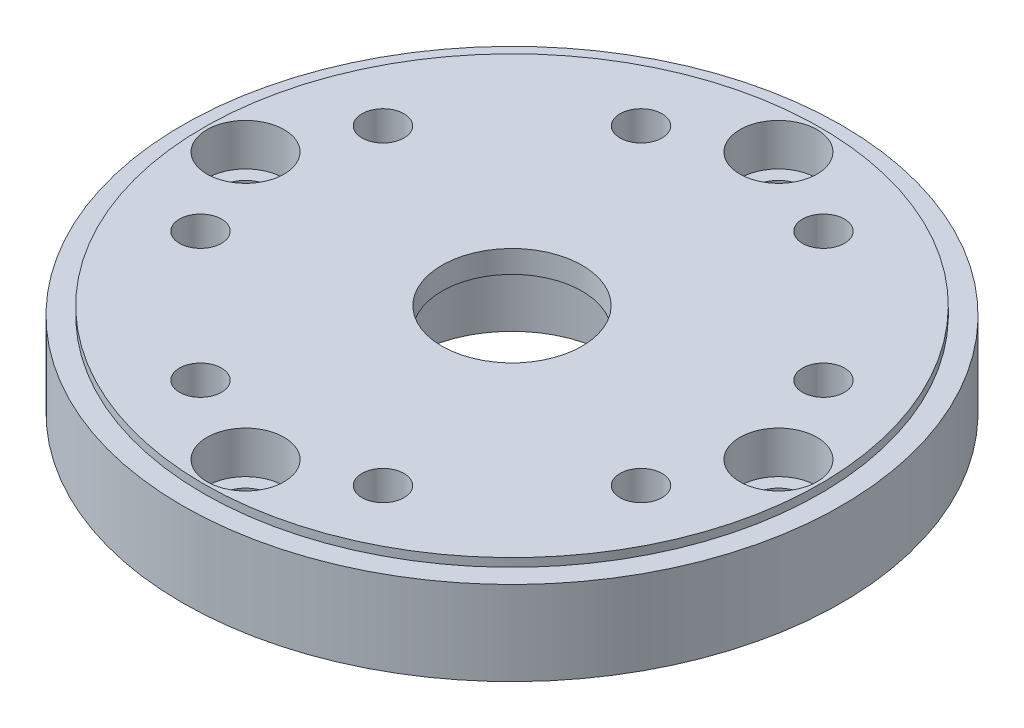
ISO-10303-21;
HEADER;
FILE_DESCRIPTION(('STEP AP214'),'2;1');
FILE_NAME('part.step','',(''),(''),'','','');
FILE_SCHEMA(('AUTOMOTIVE_DESIGN { 1 0 10303 214 1 1 1 1 }'));
ENDSEC;
DATA;
#1=APPLICATION_CONTEXT('core data for automotive mechanical design processes');
#2=APPLICATION_PROTOCOL_DEFINITION('international standard','automotive_design',2000,#1);
#3=PRODUCT_CONTEXT('',#1,'mechanical');
#4=PRODUCT('Part','Part','',(#3));
#5=PRODUCT_RELATED_PRODUCT_CATEGORY('part','',(#4));
#6=PRODUCT_DEFINITION_FORMATION('','',#4);
#7=PRODUCT_DEFINITION_CONTEXT('part definition',#1,'design');
#8=PRODUCT_DEFINITION('design','',#6,#7);
#9=PRODUCT_DEFINITION_SHAPE('','',#8);
#10=(LENGTH_UNIT() NAMED_UNIT(*) SI_UNIT(.MILLI.,.METRE.));
#11=(NAMED_UNIT(*) PLANE_ANGLE_UNIT() SI_UNIT($,.RADIAN.));
#12=(NAMED_UNIT(*) SI_UNIT($,.STERADIAN.) SOLID_ANGLE_UNIT());
#13=UNCERTAINTY_MEASURE_WITH_UNIT(LENGTH_MEASURE(1.E-05),#10,'distance_accuracy_value','');
#14=(GEOMETRIC_REPRESENTATION_CONTEXT(3) GLOBAL_UNCERTAINTY_ASSIGNED_CONTEXT((#13)) GLOBAL_UNIT_ASSIGNED_CONTEXT((#10,
#11,#12)) REPRESENTATION_CONTEXT('',''));
#15=CARTESIAN_POINT('',(0.,0.,0.));
#16=DIRECTION('',(0.,0.,1.));
#17=DIRECTION('',(1.,0.,0.));
#18=AXIS2_PLACEMENT_3D('',#15,#16,#17);
#19=CARTESIAN_POINT('',(-18.9999999999994,6.6,-5.67025844789061E-13));
#20=DIRECTION('',(0.,-1.,0.));
#21=DIRECTION('',(0.,0.,-1.));
#22=AXIS2_PLACEMENT_3D('',#19,#20,#21);
#23=CYLINDRICAL_SURFACE('',#22,1.75);
#24=CARTESIAN_POINT('',(-18.9999999999994,0.,-5.67025844789061E-13));
#25=DIRECTION('',(0.,-1.,0.));
#26=DIRECTION('',(0.,0.,-1.));
#27=AXIS2_PLACEMENT_3D('',#24,#25,#26);
#28=CIRCLE('',#27,1.75);
#29=CARTESIAN_POINT('',(-18.9999999999994,0.,-1.75000000000057));
#30=VERTEX_POINT('',#29);
#31=EDGE_CURVE('E90',#30,#30,#28,.T.);
#32=ORIENTED_EDGE('',*,*,#31,.T.);
#33=EDGE_LOOP('',(#32));
#34=FACE_BOUND('',#33,.T.);
#35=CARTESIAN_POINT('',(-18.9999999999994,3.6,-5.67025844789061E-13));
#36=DIRECTION('',(0.,1.,0.));
#37=DIRECTION('',(0.,0.,1.));
#38=AXIS2_PLACEMENT_3D('',#35,#36,#37);
#39=CIRCLE('',#38,1.75);
#40=CARTESIAN_POINT('',(-18.9999999999994,3.6,1.74999999999943));
#41=VERTEX_POINT('',#40);
#42=EDGE_CURVE('E129',#41,#41,#39,.T.);
#43=ORIENTED_EDGE('',*,*,#42,.T.);
#44=EDGE_LOOP('',(#43));
#45=FACE_BOUND('',#44,.T.);
#46=ADVANCED_FACE('F39',(#34,#45),#23,.F.);
#47=CARTESIAN_POINT('',(1.12939803174136E-12,6.6,-19.));
#48=DIRECTION('',(0.,-1.,0.));
#49=DIRECTION('',(0.,0.,-1.));
#50=AXIS2_PLACEMENT_3D('',#47,#48,#49);
#51=CYLINDRICAL_SURFACE('',#50,1.75);
#52=CARTESIAN_POINT('',(1.12939803174136E-12,0.,-19.));
#53=DIRECTION('',(0.,-1.,0.));
#54=DIRECTION('',(0.,0.,-1.));
#55=AXIS2_PLACEMENT_3D('',#52,#53,#54);
#56=CIRCLE('',#55,1.75);
#57=CARTESIAN_POINT('',(1.12939803174136E-12,0.,-20.75));
#58=VERTEX_POINT('',#57);
#59=EDGE_CURVE('E94',#58,#58,#56,.T.);
#60=ORIENTED_EDGE('',*,*,#59,.T.);
#61=EDGE_LOOP('',(#60));
#62=FACE_BOUND('',#61,.T.);
#63=CARTESIAN_POINT('',(1.12939803174136E-12,3.6,-19.));
#64=DIRECTION('',(0.,1.,0.));
#65=DIRECTION('',(0.,0.,1.));
#66=AXIS2_PLACEMENT_3D('',#63,#64,#65);
#67=CIRCLE('',#66,1.75);
#68=CARTESIAN_POINT('',(1.12939803174136E-12,3.6,-17.25));
#69=VERTEX_POINT('',#68);
#70=EDGE_CURVE('E133',#69,#69,#67,.T.);
#71=ORIENTED_EDGE('',*,*,#70,.T.);
#72=EDGE_LOOP('',(#71));
#73=FACE_BOUND('',#72,.T.);
#74=ADVANCED_FACE('F246',(#62,#73),#51,.F.);
#75=CARTESIAN_POINT('',(19.0000000000006,6.6,5.64699015870681E-13));
#76=DIRECTION('',(0.,-1.,0.));
#77=DIRECTION('',(0.,0.,-1.));
#78=AXIS2_PLACEMENT_3D('',#75,#76,#77);
#79=CYLINDRICAL_SURFACE('',#78,1.75);
#80=CARTESIAN_POINT('',(19.0000000000006,0.,5.64699015870681E-13));
#81=DIRECTION('',(0.,-1.,0.));
#82=DIRECTION('',(0.,0.,-1.));
#83=AXIS2_PLACEMENT_3D('',#80,#81,#82);
#84=CIRCLE('',#83,1.75);
#85=CARTESIAN_POINT('',(19.0000000000006,0.,-1.74999999999944));
#86=VERTEX_POINT('',#85);
#87=EDGE_CURVE('E99',#86,#86,#84,.T.);
#88=ORIENTED_EDGE('',*,*,#87,.T.);
#89=EDGE_LOOP('',(#88));
#90=FACE_BOUND('',#89,.T.);
#91=CARTESIAN_POINT('',(19.0000000000006,3.6,5.64699015870681E-13));
#92=DIRECTION('',(0.,1.,0.));
#93=DIRECTION('',(0.,0.,1.));
#94=AXIS2_PLACEMENT_3D('',#91,#92,#93);
#95=CIRCLE('',#94,1.75);
#96=CARTESIAN_POINT('',(19.0000000000006,3.6,1.75000000000056));
#97=VERTEX_POINT('',#96);
#98=EDGE_CURVE('E118',#97,#97,#95,.T.);
#99=ORIENTED_EDGE('',*,*,#98,.T.);
#100=EDGE_LOOP('',(#99));
#101=FACE_BOUND('',#100,.T.);
#102=ADVANCED_FACE('F252',(#90,#101),#79,.F.);
#103=CARTESIAN_POINT('',(0.,6.6,19.));
#104=DIRECTION('',(0.,-1.,0.));
#105=DIRECTION('',(0.,0.,-1.));
#106=AXIS2_PLACEMENT_3D('',#103,#104,#105);
#107=CYLINDRICAL_SURFACE('',#106,1.75);
#108=CARTESIAN_POINT('',(0.,0.,19.));
#109=DIRECTION('',(0.,-1.,0.));
#110=DIRECTION('',(0.,0.,-1.));
#111=AXIS2_PLACEMENT_3D('',#108,#109,#110);
#112=CIRCLE('',#111,1.75);
#113=CARTESIAN_POINT('',(0.,0.,17.25));
#114=VERTEX_POINT('',#113);
#115=EDGE_CURVE('E89',#114,#114,#112,.T.);
#116=ORIENTED_EDGE('',*,*,#115,.T.);
#117=EDGE_LOOP('',(#116));
#118=FACE_BOUND('',#117,.T.);
#119=CARTESIAN_POINT('',(0.,3.6,19.));
#120=DIRECTION('',(0.,1.,0.));
#121=DIRECTION('',(0.,0.,1.));
#122=AXIS2_PLACEMENT_3D('',#119,#120,#121);
#123=CIRCLE('',#122,1.75);
#124=CARTESIAN_POINT('',(0.,3.6,20.75));
#125=VERTEX_POINT('',#124);
#126=EDGE_CURVE('E105',#125,#125,#123,.T.);
#127=ORIENTED_EDGE('',*,*,#126,.T.);
#128=EDGE_LOOP('',(#127));
#129=FACE_BOUND('',#128,.T.);
#130=ADVANCED_FACE('F259',(#118,#129),#107,.F.);
#131=CARTESIAN_POINT('',(0.,6.,0.));
#132=DIRECTION('',(0.,-1.,0.));
#133=DIRECTION('',(0.,0.,-1.));
#134=AXIS2_PLACEMENT_3D('',#131,#132,#133);
#135=CYLINDRICAL_SURFACE('',#134,7.1);
#136=CARTESIAN_POINT('',(0.,0.,0.));
#137=DIRECTION('',(0.,1.,0.));
#138=DIRECTION('',(0.,0.,1.));
#139=AXIS2_PLACEMENT_3D('',#136,#137,#138);
#140=CIRCLE('',#139,7.1);
#141=CARTESIAN_POINT('',(0.,0.,7.1));
#142=VERTEX_POINT('',#141);
#143=EDGE_CURVE('E61',#142,#142,#140,.T.);
#144=ORIENTED_EDGE('',*,*,#143,.F.);
#145=EDGE_LOOP('',(#144));
#146=FACE_BOUND('',#145,.T.);
#147=CARTESIAN_POINT('',(0.,5.,0.));
#148=DIRECTION('',(0.,1.,0.));
#149=DIRECTION('',(0.,0.,1.));
#150=AXIS2_PLACEMENT_3D('',#147,#148,#149);
#151=CIRCLE('',#150,7.1);
#152=CARTESIAN_POINT('',(0.,5.,7.1));
#153=VERTEX_POINT('',#152);
#154=EDGE_CURVE('E65',#153,#153,#151,.T.);
#155=ORIENTED_EDGE('',*,*,#154,.T.);
#156=EDGE_LOOP('',(#155));
#157=FACE_BOUND('',#156,.T.);
#158=ADVANCED_FACE('F263',(#146,#157),#135,.F.);
#159=CARTESIAN_POINT('',(0.,6.,0.));
#160=DIRECTION('',(0.,1.,0.));
#161=DIRECTION('',(0.,0.,1.));
#162=AXIS2_PLACEMENT_3D('',#159,#160,#161);
#163=PLANE('',#162);
#164=CARTESIAN_POINT('',(0.,6.,0.));
#165=DIRECTION('',(0.,1.,0.));
#166=DIRECTION('',(0.,0.,1.));
#167=AXIS2_PLACEMENT_3D('',#164,#165,#166);
#168=CIRCLE('',#167,22.);
#169=CARTESIAN_POINT('',(0.,6.,22.));
#170=VERTEX_POINT('',#169);
#171=EDGE_CURVE('E10',#170,#170,#168,.T.);
#172=ORIENTED_EDGE('',*,*,#171,.F.);
#173=EDGE_LOOP('',(#172));
#174=FACE_BOUND('',#173,.T.);
#175=CARTESIAN_POINT('',(0.,6.,0.));
#176=DIRECTION('',(0.,1.,0.));
#177=DIRECTION('',(0.,0.,1.));
#178=AXIS2_PLACEMENT_3D('',#175,#176,#177);
#179=CIRCLE('',#178,23.5);
#180=CARTESIAN_POINT('',(0.,6.,23.5));
#181=VERTEX_POINT('',#180);
#182=EDGE_CURVE('E47',#181,#181,#179,.T.);
#183=ORIENTED_EDGE('',*,*,#182,.T.);
#184=EDGE_LOOP('',(#183));
#185=FACE_BOUND('',#184,.T.);
#186=ADVANCED_FACE('F333',(#174,#185),#163,.T.);
#187=CARTESIAN_POINT('',(0.,0.,0.));
#188=DIRECTION('',(0.,1.,0.));
#189=DIRECTION('',(0.,0.,1.));
#190=AXIS2_PLACEMENT_3D('',#187,#188,#189);
#191=PLANE('',#190);
#192=CARTESIAN_POINT('',(-15.7059520526912,0.,-6.50561835020595));
#193=DIRECTION('',(0.,1.,0.));
#194=DIRECTION('',(0.,0.,1.));
#195=AXIS2_PLACEMENT_3D('',#192,#193,#194);
#196=CIRCLE('',#195,1.5);
#197=CARTESIAN_POINT('',(-15.7059520526912,0.,-5.00561835020595));
#198=VERTEX_POINT('',#197);
#199=EDGE_CURVE('E158',#198,#198,#196,.T.);
#200=ORIENTED_EDGE('',*,*,#199,.T.);
#201=EDGE_LOOP('',(#200));
#202=FACE_BOUND('',#201,.T.);
#203=CARTESIAN_POINT('',(-15.7059520526902,0.,6.50561835020699));
#204=DIRECTION('',(0.,1.,0.));
#205=DIRECTION('',(0.,0.,1.));
#206=AXIS2_PLACEMENT_3D('',#203,#204,#205);
#207=CIRCLE('',#206,1.5);
#208=CARTESIAN_POINT('',(-15.7059520526902,0.,8.00561835020699));
#209=VERTEX_POINT('',#208);
#210=EDGE_CURVE('E166',#209,#209,#207,.T.);
#211=ORIENTED_EDGE('',*,*,#210,.T.);
#212=EDGE_LOOP('',(#211));
#213=FACE_BOUND('',#212,.T.);
#214=CARTESIAN_POINT('',(-6.50561835020431,0.,15.7059520526916));
#215=DIRECTION('',(0.,1.,0.));
#216=DIRECTION('',(0.,0.,1.));
#217=AXIS2_PLACEMENT_3D('',#214,#215,#216);
#218=CIRCLE('',#217,1.5);
#219=CARTESIAN_POINT('',(-6.50561835020431,0.,17.2059520526916));
#220=VERTEX_POINT('',#219);
#221=EDGE_CURVE('E174',#220,#220,#218,.T.);
#222=ORIENTED_EDGE('',*,*,#221,.T.);
#223=EDGE_LOOP('',(#222));
#224=FACE_BOUND('',#223,.T.);
#225=CARTESIAN_POINT('',(6.50561835020862,0.,15.7059520526907));
#226=DIRECTION('',(0.,1.,0.));
#227=DIRECTION('',(0.,0.,1.));
#228=AXIS2_PLACEMENT_3D('',#225,#226,#227);
#229=CIRCLE('',#228,1.5);
#230=CARTESIAN_POINT('',(6.50561835020862,0.,17.2059520526907));
#231=VERTEX_POINT('',#230);
#232=EDGE_CURVE('E182',#231,#231,#229,.T.);
#233=ORIENTED_EDGE('',*,*,#232,.T.);
#234=EDGE_LOOP('',(#233));
#235=FACE_BOUND('',#234,.T.);
#236=CARTESIAN_POINT('',(15.7059520526932,0.,6.50561835020476));
#237=DIRECTION('',(0.,1.,0.));
#238=DIRECTION('',(0.,0.,1.));
#239=AXIS2_PLACEMENT_3D('',#236,#237,#238);
#240=CIRCLE('',#239,1.5);
#241=CARTESIAN_POINT('',(15.7059520526932,0.,8.00561835020476));
#242=VERTEX_POINT('',#241);
#243=EDGE_CURVE('E190',#242,#242,#240,.T.);
#244=ORIENTED_EDGE('',*,*,#243,.T.);
#245=EDGE_LOOP('',(#244));
#246=FACE_BOUND('',#245,.T.);
#247=CARTESIAN_POINT('',(15.7059520526923,0.,-6.50561835020817));
#248=DIRECTION('',(0.,1.,0.));
#249=DIRECTION('',(0.,0.,1.));
#250=AXIS2_PLACEMENT_3D('',#247,#248,#249);
#251=CIRCLE('',#250,1.5);
#252=CARTESIAN_POINT('',(15.7059520526923,0.,-5.00561835020817));
#253=VERTEX_POINT('',#252);
#254=EDGE_CURVE('E197',#253,#253,#251,.T.);
#255=ORIENTED_EDGE('',*,*,#254,.T.);
#256=EDGE_LOOP('',(#255));
#257=FACE_BOUND('',#256,.T.);
#258=CARTESIAN_POINT('',(6.5056183502064,0.,-15.7059520526928));
#259=DIRECTION('',(0.,1.,0.));
#260=DIRECTION('',(0.,0.,1.));
#261=AXIS2_PLACEMENT_3D('',#258,#259,#260);
#262=CIRCLE('',#261,1.5);
#263=CARTESIAN_POINT('',(6.5056183502064,0.,-14.2059520526928));
#264=VERTEX_POINT('',#263);
#265=EDGE_CURVE('E204',#264,#264,#262,.T.);
#266=ORIENTED_EDGE('',*,*,#265,.T.);
#267=EDGE_LOOP('',(#266));
#268=FACE_BOUND('',#267,.T.);
#269=CARTESIAN_POINT('',(-6.50561835020654,0.,-15.7059520526919));
#270=DIRECTION('',(0.,1.,0.));
#271=DIRECTION('',(0.,0.,1.));
#272=AXIS2_PLACEMENT_3D('',#269,#270,#271);
#273=CIRCLE('',#272,1.5);
#274=CARTESIAN_POINT('',(-6.50561835020654,0.,-14.2059520526919));
#275=VERTEX_POINT('',#274);
#276=EDGE_CURVE('E114',#275,#275,#273,.T.);
#277=ORIENTED_EDGE('',*,*,#276,.T.);
#278=EDGE_LOOP('',(#277));
#279=FACE_BOUND('',#278,.T.);
#280=ORIENTED_EDGE('',*,*,#115,.F.);
#281=EDGE_LOOP('',(#280));
#282=FACE_BOUND('',#281,.T.);
#283=ORIENTED_EDGE('',*,*,#87,.F.);
#284=EDGE_LOOP('',(#283));
#285=FACE_BOUND('',#284,.T.);
#286=ORIENTED_EDGE('',*,*,#59,.F.);
#287=EDGE_LOOP('',(#286));
#288=FACE_BOUND('',#287,.T.);
#289=ORIENTED_EDGE('',*,*,#31,.F.);
#290=EDGE_LOOP('',(#289));
#291=FACE_BOUND('',#290,.T.);
#292=CARTESIAN_POINT('',(0.,0.,0.));
#293=DIRECTION('',(0.,1.,0.));
#294=DIRECTION('',(0.,0.,1.));
#295=AXIS2_PLACEMENT_3D('',#292,#293,#294);
#296=CIRCLE('',#295,23.5);
#297=CARTESIAN_POINT('',(0.,0.,23.5));
#298=VERTEX_POINT('',#297);
#299=EDGE_CURVE('E54',#298,#298,#296,.T.);
#300=ORIENTED_EDGE('',*,*,#299,.F.);
#301=EDGE_LOOP('',(#300));
#302=FACE_BOUND('',#301,.T.);
#303=ORIENTED_EDGE('',*,*,#143,.T.);
#304=EDGE_LOOP('',(#303));
#305=FACE_BOUND('',#304,.T.);
#306=ADVANCED_FACE('F330',(#202,#213,#224,#235,#246,#257,#268,#279,#282,#285,#288,#291,#302,
#305),#191,.F.);
#307=CARTESIAN_POINT('',(0.,6.,0.));
#308=DIRECTION('',(0.,-1.,0.));
#309=DIRECTION('',(0.,0.,-1.));
#310=AXIS2_PLACEMENT_3D('',#307,#308,#309);
#311=CYLINDRICAL_SURFACE('',#310,23.5);
#312=ORIENTED_EDGE('',*,*,#182,.F.);
#313=EDGE_LOOP('',(#312));
#314=FACE_BOUND('',#313,.T.);
#315=ORIENTED_EDGE('',*,*,#299,.T.);
#316=EDGE_LOOP('',(#315));
#317=FACE_BOUND('',#316,.T.);
#318=ADVANCED_FACE('F41',(#314,#317),#311,.T.);
#319=CARTESIAN_POINT('',(0.,5.,0.));
#320=DIRECTION('',(0.,1.,0.));
#321=DIRECTION('',(0.,0.,1.));
#322=AXIS2_PLACEMENT_3D('',#319,#320,#321);
#323=PLANE('',#322);
#324=CARTESIAN_POINT('',(0.,5.,0.));
#325=DIRECTION('',(0.,1.,0.));
#326=DIRECTION('',(0.,0.,1.));
#327=AXIS2_PLACEMENT_3D('',#324,#325,#326);
#328=CIRCLE('',#327,5.);
#329=CARTESIAN_POINT('',(0.,5.,5.));
#330=VERTEX_POINT('',#329);
#331=EDGE_CURVE('E68',#330,#330,#328,.T.);
#332=ORIENTED_EDGE('',*,*,#331,.T.);
#333=EDGE_LOOP('',(#332));
#334=FACE_BOUND('',#333,.T.);
#335=ORIENTED_EDGE('',*,*,#154,.F.);
#336=EDGE_LOOP('',(#335));
#337=FACE_BOUND('',#336,.T.);
#338=ADVANCED_FACE('F242',(#334,#337),#323,.F.);
#339=CARTESIAN_POINT('',(0.,5.,0.));
#340=DIRECTION('',(0.,1.,0.));
#341=DIRECTION('',(0.,0.,1.));
#342=AXIS2_PLACEMENT_3D('',#339,#340,#341);
#343=CYLINDRICAL_SURFACE('',#342,22.);
#344=ORIENTED_EDGE('',*,*,#171,.T.);
#345=EDGE_LOOP('',(#344));
#346=FACE_BOUND('',#345,.T.);
#347=CARTESIAN_POINT('',(0.,6.6,0.));
#348=DIRECTION('',(0.,1.,0.));
#349=DIRECTION('',(0.,0.,1.));
#350=AXIS2_PLACEMENT_3D('',#347,#348,#349);
#351=CIRCLE('',#350,22.);
#352=CARTESIAN_POINT('',(0.,6.6,22.));
#353=VERTEX_POINT('',#352);
#354=EDGE_CURVE('E77',#353,#353,#351,.T.);
#355=ORIENTED_EDGE('',*,*,#354,.F.);
#356=EDGE_LOOP('',(#355));
#357=FACE_BOUND('',#356,.T.);
#358=ADVANCED_FACE('F236',(#346,#357),#343,.T.);
#359=CARTESIAN_POINT('',(0.,5.,0.));
#360=DIRECTION('',(0.,1.,0.));
#361=DIRECTION('',(0.,0.,1.));
#362=AXIS2_PLACEMENT_3D('',#359,#360,#361);
#363=CYLINDRICAL_SURFACE('',#362,5.);
#364=ORIENTED_EDGE('',*,*,#331,.F.);
#365=EDGE_LOOP('',(#364));
#366=FACE_BOUND('',#365,.T.);
#367=CARTESIAN_POINT('',(0.,6.6,0.));
#368=DIRECTION('',(0.,1.,0.));
#369=DIRECTION('',(0.,0.,1.));
#370=AXIS2_PLACEMENT_3D('',#367,#368,#369);
#371=CIRCLE('',#370,5.);
#372=CARTESIAN_POINT('',(0.,6.6,5.));
#373=VERTEX_POINT('',#372);
#374=EDGE_CURVE('E83',#373,#373,#371,.T.);
#375=ORIENTED_EDGE('',*,*,#374,.T.);
#376=EDGE_LOOP('',(#375));
#377=FACE_BOUND('',#376,.T.);
#378=ADVANCED_FACE('F218',(#366,#377),#363,.F.);
#379=CARTESIAN_POINT('',(0.,6.6,0.));
#380=DIRECTION('',(0.,1.,0.));
#381=DIRECTION('',(0.,0.,1.));
#382=AXIS2_PLACEMENT_3D('',#379,#380,#381);
#383=PLANE('',#382);
#384=CARTESIAN_POINT('',(-15.7059520526912,6.6,-6.50561835020595));
#385=DIRECTION('',(0.,1.,0.));
#386=DIRECTION('',(0.,0.,1.));
#387=AXIS2_PLACEMENT_3D('',#384,#385,#386);
#388=CIRCLE('',#387,1.5);
#389=CARTESIAN_POINT('',(-15.7059520526912,6.6,-5.00561835020595));
#390=VERTEX_POINT('',#389);
#391=EDGE_CURVE('E162',#390,#390,#388,.T.);
#392=ORIENTED_EDGE('',*,*,#391,.F.);
#393=EDGE_LOOP('',(#392));
#394=FACE_BOUND('',#393,.T.);
#395=CARTESIAN_POINT('',(-15.7059520526902,6.6,6.50561835020699));
#396=DIRECTION('',(0.,1.,0.));
#397=DIRECTION('',(0.,0.,1.));
#398=AXIS2_PLACEMENT_3D('',#395,#396,#397);
#399=CIRCLE('',#398,1.5);
#400=CARTESIAN_POINT('',(-15.7059520526902,6.6,8.00561835020699));
#401=VERTEX_POINT('',#400);
#402=EDGE_CURVE('E170',#401,#401,#399,.T.);
#403=ORIENTED_EDGE('',*,*,#402,.F.);
#404=EDGE_LOOP('',(#403));
#405=FACE_BOUND('',#404,.T.);
#406=CARTESIAN_POINT('',(-6.50561835020431,6.6,15.7059520526916));
#407=DIRECTION('',(0.,1.,0.));
#408=DIRECTION('',(0.,0.,1.));
#409=AXIS2_PLACEMENT_3D('',#406,#407,#408);
#410=CIRCLE('',#409,1.5);
#411=CARTESIAN_POINT('',(-6.50561835020431,6.6,17.2059520526916));
#412=VERTEX_POINT('',#411);
#413=EDGE_CURVE('E178',#412,#412,#410,.T.);
#414=ORIENTED_EDGE('',*,*,#413,.F.);
#415=EDGE_LOOP('',(#414));
#416=FACE_BOUND('',#415,.T.);
#417=CARTESIAN_POINT('',(6.50561835020862,6.6,15.7059520526907));
#418=DIRECTION('',(0.,1.,0.));
#419=DIRECTION('',(0.,0.,1.));
#420=AXIS2_PLACEMENT_3D('',#417,#418,#419);
#421=CIRCLE('',#420,1.5);
#422=CARTESIAN_POINT('',(6.50561835020862,6.6,17.2059520526907));
#423=VERTEX_POINT('',#422);
#424=EDGE_CURVE('E186',#423,#423,#421,.T.);
#425=ORIENTED_EDGE('',*,*,#424,.F.);
#426=EDGE_LOOP('',(#425));
#427=FACE_BOUND('',#426,.T.);
#428=CARTESIAN_POINT('',(15.7059520526932,6.6,6.50561835020476));
#429=DIRECTION('',(0.,1.,0.));
#430=DIRECTION('',(0.,0.,1.));
#431=AXIS2_PLACEMENT_3D('',#428,#429,#430);
#432=CIRCLE('',#431,1.5);
#433=CARTESIAN_POINT('',(15.7059520526932,6.6,8.00561835020476));
#434=VERTEX_POINT('',#433);
#435=EDGE_CURVE('E193',#434,#434,#432,.T.);
#436=ORIENTED_EDGE('',*,*,#435,.F.);
#437=EDGE_LOOP('',(#436));
#438=FACE_BOUND('',#437,.T.);
#439=CARTESIAN_POINT('',(15.7059520526923,6.6,-6.50561835020817));
#440=DIRECTION('',(0.,1.,0.));
#441=DIRECTION('',(0.,0.,1.));
#442=AXIS2_PLACEMENT_3D('',#439,#440,#441);
#443=CIRCLE('',#442,1.5);
#444=CARTESIAN_POINT('',(15.7059520526923,6.6,-5.00561835020817));
#445=VERTEX_POINT('',#444);
#446=EDGE_CURVE('E201',#445,#445,#443,.T.);
#447=ORIENTED_EDGE('',*,*,#446,.F.);
#448=EDGE_LOOP('',(#447));
#449=FACE_BOUND('',#448,.T.);
#450=CARTESIAN_POINT('',(6.5056183502064,6.6,-15.7059520526928));
#451=DIRECTION('',(0.,1.,0.));
#452=DIRECTION('',(0.,0.,1.));
#453=AXIS2_PLACEMENT_3D('',#450,#451,#452);
#454=CIRCLE('',#453,1.5);
#455=CARTESIAN_POINT('',(6.5056183502064,6.6,-14.2059520526928));
#456=VERTEX_POINT('',#455);
#457=EDGE_CURVE('E155',#456,#456,#454,.T.);
#458=ORIENTED_EDGE('',*,*,#457,.F.);
#459=EDGE_LOOP('',(#458));
#460=FACE_BOUND('',#459,.T.);
#461=CARTESIAN_POINT('',(-6.50561835020654,6.6,-15.7059520526919));
#462=DIRECTION('',(0.,1.,0.));
#463=DIRECTION('',(0.,0.,1.));
#464=AXIS2_PLACEMENT_3D('',#461,#462,#463);
#465=CIRCLE('',#464,1.5);
#466=CARTESIAN_POINT('',(-6.50561835020654,6.6,-14.2059520526919));
#467=VERTEX_POINT('',#466);
#468=EDGE_CURVE('E151',#467,#467,#465,.T.);
#469=ORIENTED_EDGE('',*,*,#468,.F.);
#470=EDGE_LOOP('',(#469));
#471=FACE_BOUND('',#470,.T.);
#472=CARTESIAN_POINT('',(1.12939803174136E-12,6.6,-19.));
#473=DIRECTION('',(0.,1.,0.));
#474=DIRECTION('',(0.,0.,1.));
#475=AXIS2_PLACEMENT_3D('',#472,#473,#474);
#476=CIRCLE('',#475,2.75);
#477=CARTESIAN_POINT('',(1.12939803174136E-12,6.6,-16.25));
#478=VERTEX_POINT('',#477);
#479=EDGE_CURVE('E141',#478,#478,#476,.T.);
#480=ORIENTED_EDGE('',*,*,#479,.F.);
#481=EDGE_LOOP('',(#480));
#482=FACE_BOUND('',#481,.T.);
#483=CARTESIAN_POINT('',(-18.9999999999994,6.6,-5.67025844789061E-13));
#484=DIRECTION('',(0.,1.,0.));
#485=DIRECTION('',(0.,0.,1.));
#486=AXIS2_PLACEMENT_3D('',#483,#484,#485);
#487=CIRCLE('',#486,2.75);
#488=CARTESIAN_POINT('',(-18.9999999999994,6.6,2.74999999999943));
#489=VERTEX_POINT('',#488);
#490=EDGE_CURVE('E134',#489,#489,#487,.T.);
#491=ORIENTED_EDGE('',*,*,#490,.F.);
#492=EDGE_LOOP('',(#491));
#493=FACE_BOUND('',#492,.T.);
#494=CARTESIAN_POINT('',(19.0000000000006,6.6,5.64699015870681E-13));
#495=DIRECTION('',(0.,1.,0.));
#496=DIRECTION('',(0.,0.,1.));
#497=AXIS2_PLACEMENT_3D('',#494,#495,#496);
#498=CIRCLE('',#497,2.75);
#499=CARTESIAN_POINT('',(19.0000000000006,6.6,2.75000000000056));
#500=VERTEX_POINT('',#499);
#501=EDGE_CURVE('E122',#500,#500,#498,.T.);
#502=ORIENTED_EDGE('',*,*,#501,.F.);
#503=EDGE_LOOP('',(#502));
#504=FACE_BOUND('',#503,.T.);
#505=CARTESIAN_POINT('',(0.,6.6,19.));
#506=DIRECTION('',(0.,1.,0.));
#507=DIRECTION('',(0.,0.,1.));
#508=AXIS2_PLACEMENT_3D('',#505,#506,#507);
#509=CIRCLE('',#508,2.75);
#510=CARTESIAN_POINT('',(0.,6.6,21.75));
#511=VERTEX_POINT('',#510);
#512=EDGE_CURVE('E109',#511,#511,#509,.T.);
#513=ORIENTED_EDGE('',*,*,#512,.F.);
#514=EDGE_LOOP('',(#513));
#515=FACE_BOUND('',#514,.T.);
#516=ORIENTED_EDGE('',*,*,#354,.T.);
#517=EDGE_LOOP('',(#516));
#518=FACE_BOUND('',#517,.T.);
#519=ORIENTED_EDGE('',*,*,#374,.F.);
#520=EDGE_LOOP('',(#519));
#521=FACE_BOUND('',#520,.T.);
#522=ADVANCED_FACE('F214',(#394,#405,#416,#427,#438,#449,#460,#471,#482,#493,#504,#515,#518,
#521),#383,.T.);
#523=CARTESIAN_POINT('',(0.,3.6,19.));
#524=DIRECTION('',(0.,1.,0.));
#525=DIRECTION('',(0.,0.,1.));
#526=AXIS2_PLACEMENT_3D('',#523,#524,#525);
#527=CYLINDRICAL_SURFACE('',#526,2.75);
#528=CARTESIAN_POINT('',(0.,3.6,19.));
#529=DIRECTION('',(0.,1.,0.));
#530=DIRECTION('',(0.,0.,1.));
#531=AXIS2_PLACEMENT_3D('',#528,#529,#530);
#532=CIRCLE('',#531,2.75);
#533=CARTESIAN_POINT('',(0.,3.6,21.75));
#534=VERTEX_POINT('',#533);
#535=EDGE_CURVE('E110',#534,#534,#532,.T.);
#536=ORIENTED_EDGE('',*,*,#535,.F.);
#537=EDGE_LOOP('',(#536));
#538=FACE_BOUND('',#537,.T.);
#539=ORIENTED_EDGE('',*,*,#512,.T.);
#540=EDGE_LOOP('',(#539));
#541=FACE_BOUND('',#540,.T.);
#542=ADVANCED_FACE('F217',(#538,#541),#527,.F.);
#543=CARTESIAN_POINT('',(0.,3.6,19.));
#544=DIRECTION('',(0.,1.,0.));
#545=DIRECTION('',(0.,0.,1.));
#546=AXIS2_PLACEMENT_3D('',#543,#544,#545);
#547=PLANE('',#546);
#548=ORIENTED_EDGE('',*,*,#126,.F.);
#549=EDGE_LOOP('',(#548));
#550=FACE_BOUND('',#549,.T.);
#551=ORIENTED_EDGE('',*,*,#535,.T.);
#552=EDGE_LOOP('',(#551));
#553=FACE_BOUND('',#552,.T.);
#554=ADVANCED_FACE('F265',(#550,#553),#547,.T.);
#555=CARTESIAN_POINT('',(19.0000000000006,3.6,5.64699015870681E-13));
#556=DIRECTION('',(0.,1.,0.));
#557=DIRECTION('',(0.,0.,1.));
#558=AXIS2_PLACEMENT_3D('',#555,#556,#557);
#559=CYLINDRICAL_SURFACE('',#558,2.75);
#560=CARTESIAN_POINT('',(19.0000000000006,3.6,5.64699015870681E-13));
#561=DIRECTION('',(0.,1.,0.));
#562=DIRECTION('',(0.,0.,1.));
#563=AXIS2_PLACEMENT_3D('',#560,#561,#562);
#564=CIRCLE('',#563,2.75);
#565=CARTESIAN_POINT('',(19.0000000000006,3.6,2.75000000000056));
#566=VERTEX_POINT('',#565);
#567=EDGE_CURVE('E108',#566,#566,#564,.T.);
#568=ORIENTED_EDGE('',*,*,#567,.F.);
#569=EDGE_LOOP('',(#568));
#570=FACE_BOUND('',#569,.T.);
#571=ORIENTED_EDGE('',*,*,#501,.T.);
#572=EDGE_LOOP('',(#571));
#573=FACE_BOUND('',#572,.T.);
#574=ADVANCED_FACE('F268',(#570,#573),#559,.F.);
#575=CARTESIAN_POINT('',(19.0000000000006,3.6,5.64699015870681E-13));
#576=DIRECTION('',(0.,1.,0.));
#577=DIRECTION('',(0.,0.,1.));
#578=AXIS2_PLACEMENT_3D('',#575,#576,#577);
#579=PLANE('',#578);
#580=ORIENTED_EDGE('',*,*,#98,.F.);
#581=EDGE_LOOP('',(#580));
#582=FACE_BOUND('',#581,.T.);
#583=ORIENTED_EDGE('',*,*,#567,.T.);
#584=EDGE_LOOP('',(#583));
#585=FACE_BOUND('',#584,.T.);
#586=ADVANCED_FACE('F273',(#582,#585),#579,.T.);
#587=CARTESIAN_POINT('',(1.12939803174136E-12,3.6,-19.));
#588=DIRECTION('',(0.,1.,0.));
#589=DIRECTION('',(0.,0.,1.));
#590=AXIS2_PLACEMENT_3D('',#587,#588,#589);
#591=CYLINDRICAL_SURFACE('',#590,2.75);
#592=CARTESIAN_POINT('',(1.12939803174136E-12,3.6,-19.));
#593=DIRECTION('',(0.,1.,0.));
#594=DIRECTION('',(0.,0.,1.));
#595=AXIS2_PLACEMENT_3D('',#592,#593,#594);
#596=CIRCLE('',#595,2.75);
#597=CARTESIAN_POINT('',(1.12939803174136E-12,3.6,-16.25));
#598=VERTEX_POINT('',#597);
#599=EDGE_CURVE('E95',#598,#598,#596,.T.);
#600=ORIENTED_EDGE('',*,*,#599,.F.);
#601=EDGE_LOOP('',(#600));
#602=FACE_BOUND('',#601,.T.);
#603=ORIENTED_EDGE('',*,*,#479,.T.);
#604=EDGE_LOOP('',(#603));
#605=FACE_BOUND('',#604,.T.);
#606=ADVANCED_FACE('F276',(#602,#605),#591,.F.);
#607=CARTESIAN_POINT('',(1.12939803174136E-12,3.6,-19.));
#608=DIRECTION('',(0.,1.,0.));
#609=DIRECTION('',(0.,0.,1.));
#610=AXIS2_PLACEMENT_3D('',#607,#608,#609);
#611=PLANE('',#610);
#612=ORIENTED_EDGE('',*,*,#70,.F.);
#613=EDGE_LOOP('',(#612));
#614=FACE_BOUND('',#613,.T.);
#615=ORIENTED_EDGE('',*,*,#599,.T.);
#616=EDGE_LOOP('',(#615));
#617=FACE_BOUND('',#616,.T.);
#618=ADVANCED_FACE('F289',(#614,#617),#611,.T.);
#619=CARTESIAN_POINT('',(-18.9999999999994,3.6,-5.67025844789061E-13));
#620=DIRECTION('',(0.,1.,0.));
#621=DIRECTION('',(0.,0.,1.));
#622=AXIS2_PLACEMENT_3D('',#619,#620,#621);
#623=CYLINDRICAL_SURFACE('',#622,2.75);
#624=CARTESIAN_POINT('',(-18.9999999999994,3.6,-5.67025844789061E-13));
#625=DIRECTION('',(0.,1.,0.));
#626=DIRECTION('',(0.,0.,1.));
#627=AXIS2_PLACEMENT_3D('',#624,#625,#626);
#628=CIRCLE('',#627,2.75);
#629=CARTESIAN_POINT('',(-18.9999999999994,3.6,2.74999999999943));
#630=VERTEX_POINT('',#629);
#631=EDGE_CURVE('E121',#630,#630,#628,.T.);
#632=ORIENTED_EDGE('',*,*,#631,.F.);
#633=EDGE_LOOP('',(#632));
#634=FACE_BOUND('',#633,.T.);
#635=ORIENTED_EDGE('',*,*,#490,.T.);
#636=EDGE_LOOP('',(#635));
#637=FACE_BOUND('',#636,.T.);
#638=ADVANCED_FACE('F285',(#634,#637),#623,.F.);
#639=CARTESIAN_POINT('',(-18.9999999999994,3.6,-5.67025844789061E-13));
#640=DIRECTION('',(0.,1.,0.));
#641=DIRECTION('',(0.,0.,1.));
#642=AXIS2_PLACEMENT_3D('',#639,#640,#641);
#643=PLANE('',#642);
#644=ORIENTED_EDGE('',*,*,#42,.F.);
#645=EDGE_LOOP('',(#644));
#646=FACE_BOUND('',#645,.T.);
#647=ORIENTED_EDGE('',*,*,#631,.T.);
#648=EDGE_LOOP('',(#647));
#649=FACE_BOUND('',#648,.T.);
#650=ADVANCED_FACE('F281',(#646,#649),#643,.T.);
#651=CARTESIAN_POINT('',(-6.50561835020654,0.,-15.7059520526919));
#652=DIRECTION('',(0.,1.,0.));
#653=DIRECTION('',(0.,0.,1.));
#654=AXIS2_PLACEMENT_3D('',#651,#652,#653);
#655=CYLINDRICAL_SURFACE('',#654,1.5);
#656=ORIENTED_EDGE('',*,*,#276,.F.);
#657=EDGE_LOOP('',(#656));
#658=FACE_BOUND('',#657,.T.);
#659=ORIENTED_EDGE('',*,*,#468,.T.);
#660=EDGE_LOOP('',(#659));
#661=FACE_BOUND('',#660,.T.);
#662=ADVANCED_FACE('F284',(#658,#661),#655,.F.);
#663=CARTESIAN_POINT('',(6.5056183502064,0.,-15.7059520526928));
#664=DIRECTION('',(0.,1.,0.));
#665=DIRECTION('',(0.,0.,1.));
#666=AXIS2_PLACEMENT_3D('',#663,#664,#665);
#667=CYLINDRICAL_SURFACE('',#666,1.5);
#668=ORIENTED_EDGE('',*,*,#265,.F.);
#669=EDGE_LOOP('',(#668));
#670=FACE_BOUND('',#669,.T.);
#671=ORIENTED_EDGE('',*,*,#457,.T.);
#672=EDGE_LOOP('',(#671));
#673=FACE_BOUND('',#672,.T.);
#674=ADVANCED_FACE('F212',(#670,#673),#667,.F.);
#675=CARTESIAN_POINT('',(15.7059520526923,0.,-6.50561835020817));
#676=DIRECTION('',(0.,1.,0.));
#677=DIRECTION('',(0.,0.,1.));
#678=AXIS2_PLACEMENT_3D('',#675,#676,#677);
#679=CYLINDRICAL_SURFACE('',#678,1.5);
#680=ORIENTED_EDGE('',*,*,#254,.F.);
#681=EDGE_LOOP('',(#680));
#682=FACE_BOUND('',#681,.T.);
#683=ORIENTED_EDGE('',*,*,#446,.T.);
#684=EDGE_LOOP('',(#683));
#685=FACE_BOUND('',#684,.T.);
#686=ADVANCED_FACE('F319',(#682,#685),#679,.F.);
#687=CARTESIAN_POINT('',(15.7059520526932,0.,6.50561835020476));
#688=DIRECTION('',(0.,1.,0.));
#689=DIRECTION('',(0.,0.,1.));
#690=AXIS2_PLACEMENT_3D('',#687,#688,#689);
#691=CYLINDRICAL_SURFACE('',#690,1.5);
#692=ORIENTED_EDGE('',*,*,#243,.F.);
#693=EDGE_LOOP('',(#692));
#694=FACE_BOUND('',#693,.T.);
#695=ORIENTED_EDGE('',*,*,#435,.T.);
#696=EDGE_LOOP('',(#695));
#697=FACE_BOUND('',#696,.T.);
#698=ADVANCED_FACE('F315',(#694,#697),#691,.F.);
#699=CARTESIAN_POINT('',(6.50561835020862,0.,15.7059520526907));
#700=DIRECTION('',(0.,1.,0.));
#701=DIRECTION('',(0.,0.,1.));
#702=AXIS2_PLACEMENT_3D('',#699,#700,#701);
#703=CYLINDRICAL_SURFACE('',#702,1.5);
#704=ORIENTED_EDGE('',*,*,#232,.F.);
#705=EDGE_LOOP('',(#704));
#706=FACE_BOUND('',#705,.T.);
#707=ORIENTED_EDGE('',*,*,#424,.T.);
#708=EDGE_LOOP('',(#707));
#709=FACE_BOUND('',#708,.T.);
#710=ADVANCED_FACE('F311',(#706,#709),#703,.F.);
#711=CARTESIAN_POINT('',(-6.50561835020431,0.,15.7059520526916));
#712=DIRECTION('',(0.,1.,0.));
#713=DIRECTION('',(0.,0.,1.));
#714=AXIS2_PLACEMENT_3D('',#711,#712,#713);
#715=CYLINDRICAL_SURFACE('',#714,1.5);
#716=ORIENTED_EDGE('',*,*,#221,.F.);
#717=EDGE_LOOP('',(#716));
#718=FACE_BOUND('',#717,.T.);
#719=ORIENTED_EDGE('',*,*,#413,.T.);
#720=EDGE_LOOP('',(#719));
#721=FACE_BOUND('',#720,.T.);
#722=ADVANCED_FACE('F307',(#718,#721),#715,.F.);
#723=CARTESIAN_POINT('',(-15.7059520526902,0.,6.50561835020699));
#724=DIRECTION('',(0.,1.,0.));
#725=DIRECTION('',(0.,0.,1.));
#726=AXIS2_PLACEMENT_3D('',#723,#724,#725);
#727=CYLINDRICAL_SURFACE('',#726,1.5);
#728=ORIENTED_EDGE('',*,*,#210,.F.);
#729=EDGE_LOOP('',(#728));
#730=FACE_BOUND('',#729,.T.);
#731=ORIENTED_EDGE('',*,*,#402,.T.);
#732=EDGE_LOOP('',(#731));
#733=FACE_BOUND('',#732,.T.);
#734=ADVANCED_FACE('F303',(#730,#733),#727,.F.);
#735=CARTESIAN_POINT('',(-15.7059520526912,0.,-6.50561835020595));
#736=DIRECTION('',(0.,1.,0.));
#737=DIRECTION('',(0.,0.,1.));
#738=AXIS2_PLACEMENT_3D('',#735,#736,#737);
#739=CYLINDRICAL_SURFACE('',#738,1.5);
#740=ORIENTED_EDGE('',*,*,#199,.F.);
#741=EDGE_LOOP('',(#740));
#742=FACE_BOUND('',#741,.T.);
#743=ORIENTED_EDGE('',*,*,#391,.T.);
#744=EDGE_LOOP('',(#743));
#745=FACE_BOUND('',#744,.T.);
#746=ADVANCED_FACE('F300',(#742,#745),#739,.F.);
#747=CLOSED_SHELL('',(#46,#74,#102,#130,#158,#186,#306,#318,#338,#358,#378,#522,#542,#554,#574,
#586,#606,#618,#638,#650,#662,#674,#686,#698,#710,#722,#734,#746));
#748=MANIFOLD_SOLID_BREP('B2',#747);
#749=ADVANCED_BREP_SHAPE_REPRESENTATION('',(#18,#748),#14);
#750=SHAPE_DEFINITION_REPRESENTATION(#9,#749);
ENDSEC;
END-ISO-10303-21;
